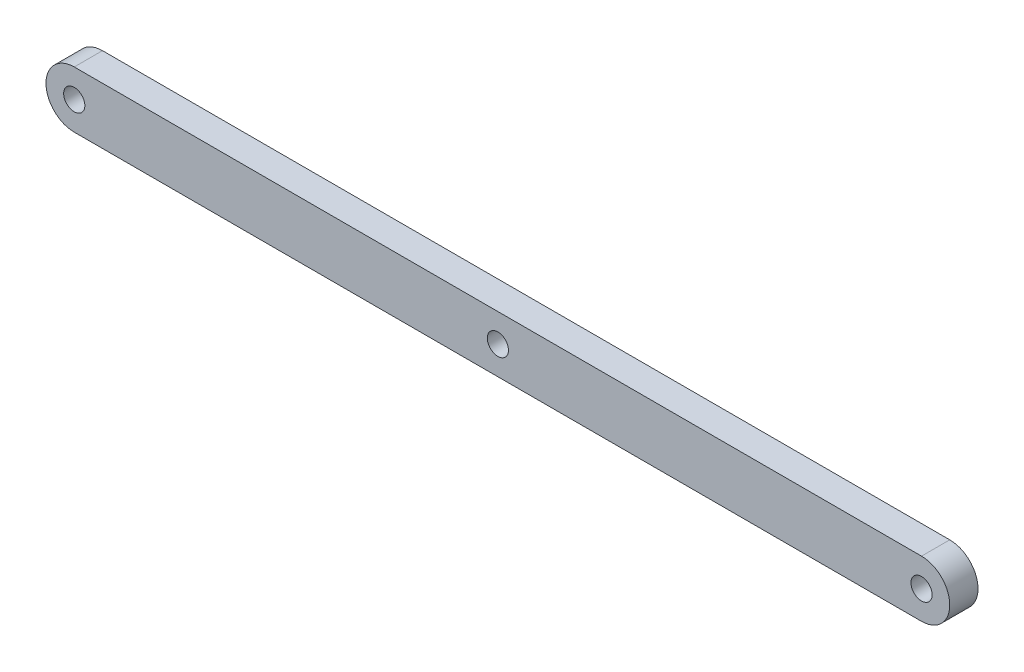
ISO-10303-21;
HEADER;
FILE_DESCRIPTION(('STEP AP214'),'2;1');
FILE_NAME('part.step','',(''),(''),'','','');
FILE_SCHEMA(('AUTOMOTIVE_DESIGN { 1 0 10303 214 1 1 1 1 }'));
ENDSEC;
DATA;
#1=APPLICATION_CONTEXT('core data for automotive mechanical design processes');
#2=APPLICATION_PROTOCOL_DEFINITION('international standard','automotive_design',2000,#1);
#3=PRODUCT_CONTEXT('',#1,'mechanical');
#4=PRODUCT('Part','Part','',(#3));
#5=PRODUCT_RELATED_PRODUCT_CATEGORY('part','',(#4));
#6=PRODUCT_DEFINITION_FORMATION('','',#4);
#7=PRODUCT_DEFINITION_CONTEXT('part definition',#1,'design');
#8=PRODUCT_DEFINITION('design','',#6,#7);
#9=PRODUCT_DEFINITION_SHAPE('','',#8);
#10=(LENGTH_UNIT() NAMED_UNIT(*) SI_UNIT(.MILLI.,.METRE.));
#11=(NAMED_UNIT(*) PLANE_ANGLE_UNIT() SI_UNIT($,.RADIAN.));
#12=(NAMED_UNIT(*) SI_UNIT($,.STERADIAN.) SOLID_ANGLE_UNIT());
#13=UNCERTAINTY_MEASURE_WITH_UNIT(LENGTH_MEASURE(1.E-05),#10,'distance_accuracy_value','');
#14=(GEOMETRIC_REPRESENTATION_CONTEXT(3) GLOBAL_UNCERTAINTY_ASSIGNED_CONTEXT((#13)) GLOBAL_UNIT_ASSIGNED_CONTEXT((#10,
#11,#12)) REPRESENTATION_CONTEXT('',''));
#15=CARTESIAN_POINT('',(0.,0.,0.));
#16=DIRECTION('',(0.,0.,1.));
#17=DIRECTION('',(1.,0.,0.));
#18=AXIS2_PLACEMENT_3D('',#15,#16,#17);
#19=CARTESIAN_POINT('',(0.,20.,-20.));
#20=DIRECTION('',(0.,0.,1.));
#21=DIRECTION('',(1.,0.,0.));
#22=AXIS2_PLACEMENT_3D('',#19,#20,#21);
#23=CYLINDRICAL_SURFACE('',#22,20.);
#24=CARTESIAN_POINT('',(0.,20.,0.));
#25=DIRECTION('',(0.,0.,1.));
#26=DIRECTION('',(1.,0.,0.));
#27=AXIS2_PLACEMENT_3D('',#24,#25,#26);
#28=CIRCLE('',#27,20.);
#29=CARTESIAN_POINT('',(0.,40.,0.));
#30=VERTEX_POINT('',#29);
#31=CARTESIAN_POINT('',(0.,0.,0.));
#32=VERTEX_POINT('',#31);
#33=EDGE_CURVE('E81',#30,#32,#28,.T.);
#34=ORIENTED_EDGE('',*,*,#33,.F.);
#35=DIRECTION('',(0.,0.,1.));
#36=VECTOR('',#35,1.);
#37=CARTESIAN_POINT('',(0.,40.,-20.));
#38=LINE('',#37,#36);
#39=CARTESIAN_POINT('',(0.,40.,-20.));
#40=VERTEX_POINT('',#39);
#41=EDGE_CURVE('E10',#40,#30,#38,.T.);
#42=ORIENTED_EDGE('',*,*,#41,.F.);
#43=CARTESIAN_POINT('',(0.,20.,-20.));
#44=DIRECTION('',(0.,0.,1.));
#45=DIRECTION('',(1.,0.,0.));
#46=AXIS2_PLACEMENT_3D('',#43,#44,#45);
#47=CIRCLE('',#46,20.);
#48=CARTESIAN_POINT('',(0.,0.,-20.));
#49=VERTEX_POINT('',#48);
#50=EDGE_CURVE('E74',#40,#49,#47,.T.);
#51=ORIENTED_EDGE('',*,*,#50,.T.);
#52=DIRECTION('',(0.,0.,1.));
#53=VECTOR('',#52,1.);
#54=CARTESIAN_POINT('',(0.,0.,-20.));
#55=LINE('',#54,#53);
#56=EDGE_CURVE('E19',#49,#32,#55,.T.);
#57=ORIENTED_EDGE('',*,*,#56,.T.);
#58=EDGE_LOOP('',(#34,#42,#51,#57));
#59=FACE_BOUND('',#58,.T.);
#60=ADVANCED_FACE('F16',(#59),#23,.T.);
#61=CARTESIAN_POINT('',(0.,40.,-20.));
#62=DIRECTION('',(0.,1.,0.));
#63=DIRECTION('',(0.,0.,1.));
#64=AXIS2_PLACEMENT_3D('',#61,#62,#63);
#65=PLANE('',#64);
#66=DIRECTION('',(-1.,0.,0.));
#67=VECTOR('',#66,1.);
#68=CARTESIAN_POINT('',(0.,40.,0.));
#69=LINE('',#68,#67);
#70=CARTESIAN_POINT('',(600.,40.,0.));
#71=VERTEX_POINT('',#70);
#72=EDGE_CURVE('E76',#71,#30,#69,.T.);
#73=ORIENTED_EDGE('',*,*,#72,.F.);
#74=DIRECTION('',(0.,0.,1.));
#75=VECTOR('',#74,1.);
#76=CARTESIAN_POINT('',(600.,40.,-20.));
#77=LINE('',#76,#75);
#78=CARTESIAN_POINT('',(600.,40.,-20.));
#79=VERTEX_POINT('',#78);
#80=EDGE_CURVE('E25',#79,#71,#77,.T.);
#81=ORIENTED_EDGE('',*,*,#80,.F.);
#82=DIRECTION('',(-1.,0.,0.));
#83=VECTOR('',#82,1.);
#84=CARTESIAN_POINT('',(0.,40.,-20.));
#85=LINE('',#84,#83);
#86=EDGE_CURVE('E71',#79,#40,#85,.T.);
#87=ORIENTED_EDGE('',*,*,#86,.T.);
#88=ORIENTED_EDGE('',*,*,#41,.T.);
#89=EDGE_LOOP('',(#73,#81,#87,#88));
#90=FACE_BOUND('',#89,.T.);
#91=ADVANCED_FACE('F92',(#90),#65,.T.);
#92=CARTESIAN_POINT('',(600.,20.,-20.));
#93=DIRECTION('',(0.,0.,1.));
#94=DIRECTION('',(1.,0.,0.));
#95=AXIS2_PLACEMENT_3D('',#92,#93,#94);
#96=CYLINDRICAL_SURFACE('',#95,20.);
#97=CARTESIAN_POINT('',(600.,20.,0.));
#98=DIRECTION('',(0.,0.,1.));
#99=DIRECTION('',(1.,0.,0.));
#100=AXIS2_PLACEMENT_3D('',#97,#98,#99);
#101=CIRCLE('',#100,20.);
#102=CARTESIAN_POINT('',(600.,0.,0.));
#103=VERTEX_POINT('',#102);
#104=EDGE_CURVE('E66',#103,#71,#101,.T.);
#105=ORIENTED_EDGE('',*,*,#104,.F.);
#106=DIRECTION('',(0.,0.,1.));
#107=VECTOR('',#106,1.);
#108=CARTESIAN_POINT('',(600.,0.,-20.));
#109=LINE('',#108,#107);
#110=CARTESIAN_POINT('',(600.,0.,-20.));
#111=VERTEX_POINT('',#110);
#112=EDGE_CURVE('E61',#111,#103,#109,.T.);
#113=ORIENTED_EDGE('',*,*,#112,.F.);
#114=CARTESIAN_POINT('',(600.,20.,-20.));
#115=DIRECTION('',(0.,0.,1.));
#116=DIRECTION('',(1.,0.,0.));
#117=AXIS2_PLACEMENT_3D('',#114,#115,#116);
#118=CIRCLE('',#117,20.);
#119=EDGE_CURVE('E64',#111,#79,#118,.T.);
#120=ORIENTED_EDGE('',*,*,#119,.T.);
#121=ORIENTED_EDGE('',*,*,#80,.T.);
#122=EDGE_LOOP('',(#105,#113,#120,#121));
#123=FACE_BOUND('',#122,.T.);
#124=ADVANCED_FACE('F63',(#123),#96,.T.);
#125=CARTESIAN_POINT('',(0.,0.,-20.));
#126=DIRECTION('',(0.,-1.,0.));
#127=DIRECTION('',(0.,0.,-1.));
#128=AXIS2_PLACEMENT_3D('',#125,#126,#127);
#129=PLANE('',#128);
#130=DIRECTION('',(1.,0.,0.));
#131=VECTOR('',#130,1.);
#132=CARTESIAN_POINT('',(0.,0.,0.));
#133=LINE('',#132,#131);
#134=EDGE_CURVE('E84',#32,#103,#133,.T.);
#135=ORIENTED_EDGE('',*,*,#134,.F.);
#136=ORIENTED_EDGE('',*,*,#56,.F.);
#137=DIRECTION('',(1.,0.,0.));
#138=VECTOR('',#137,1.);
#139=CARTESIAN_POINT('',(0.,0.,-20.));
#140=LINE('',#139,#138);
#141=EDGE_CURVE('E70',#49,#111,#140,.T.);
#142=ORIENTED_EDGE('',*,*,#141,.T.);
#143=ORIENTED_EDGE('',*,*,#112,.T.);
#144=EDGE_LOOP('',(#135,#136,#142,#143));
#145=FACE_BOUND('',#144,.T.);
#146=ADVANCED_FACE('F73',(#145),#129,.T.);
#147=CARTESIAN_POINT('',(0.,20.,-20.));
#148=DIRECTION('',(0.,0.,1.));
#149=DIRECTION('',(1.,0.,0.));
#150=AXIS2_PLACEMENT_3D('',#147,#148,#149);
#151=PLANE('',#150);
#152=CARTESIAN_POINT('',(300.,20.,-20.));
#153=DIRECTION('',(0.,0.,1.));
#154=DIRECTION('',(1.,0.,0.));
#155=AXIS2_PLACEMENT_3D('',#152,#153,#154);
#156=CIRCLE('',#155,7.5);
#157=CARTESIAN_POINT('',(307.5,20.,-20.));
#158=VERTEX_POINT('',#157);
#159=EDGE_CURVE('E134',#158,#158,#156,.T.);
#160=ORIENTED_EDGE('',*,*,#159,.T.);
#161=EDGE_LOOP('',(#160));
#162=FACE_BOUND('',#161,.T.);
#163=CARTESIAN_POINT('',(600.,20.,-20.));
#164=DIRECTION('',(0.,0.,1.));
#165=DIRECTION('',(1.,0.,0.));
#166=AXIS2_PLACEMENT_3D('',#163,#164,#165);
#167=CIRCLE('',#166,7.5);
#168=CARTESIAN_POINT('',(607.5,20.,-20.));
#169=VERTEX_POINT('',#168);
#170=EDGE_CURVE('E142',#169,#169,#167,.T.);
#171=ORIENTED_EDGE('',*,*,#170,.T.);
#172=EDGE_LOOP('',(#171));
#173=FACE_BOUND('',#172,.T.);
#174=CARTESIAN_POINT('',(0.,20.,-20.));
#175=DIRECTION('',(0.,0.,1.));
#176=DIRECTION('',(1.,0.,0.));
#177=AXIS2_PLACEMENT_3D('',#174,#175,#176);
#178=CIRCLE('',#177,7.5);
#179=CARTESIAN_POINT('',(7.5,20.,-20.));
#180=VERTEX_POINT('',#179);
#181=EDGE_CURVE('E85',#180,#180,#178,.T.);
#182=ORIENTED_EDGE('',*,*,#181,.T.);
#183=EDGE_LOOP('',(#182));
#184=FACE_BOUND('',#183,.T.);
#185=ORIENTED_EDGE('',*,*,#50,.F.);
#186=ORIENTED_EDGE('',*,*,#86,.F.);
#187=ORIENTED_EDGE('',*,*,#119,.F.);
#188=ORIENTED_EDGE('',*,*,#141,.F.);
#189=EDGE_LOOP('',(#185,#186,#187,#188));
#190=FACE_BOUND('',#189,.T.);
#191=ADVANCED_FACE('F69',(#162,#173,#184,#190),#151,.F.);
#192=CARTESIAN_POINT('',(0.,20.,0.));
#193=DIRECTION('',(0.,0.,1.));
#194=DIRECTION('',(1.,0.,0.));
#195=AXIS2_PLACEMENT_3D('',#192,#193,#194);
#196=PLANE('',#195);
#197=CARTESIAN_POINT('',(300.,20.,0.));
#198=DIRECTION('',(0.,0.,1.));
#199=DIRECTION('',(1.,0.,0.));
#200=AXIS2_PLACEMENT_3D('',#197,#198,#199);
#201=CIRCLE('',#200,7.5);
#202=CARTESIAN_POINT('',(307.5,20.,0.));
#203=VERTEX_POINT('',#202);
#204=EDGE_CURVE('E137',#203,#203,#201,.T.);
#205=ORIENTED_EDGE('',*,*,#204,.F.);
#206=EDGE_LOOP('',(#205));
#207=FACE_BOUND('',#206,.T.);
#208=CARTESIAN_POINT('',(600.,20.,0.));
#209=DIRECTION('',(0.,0.,1.));
#210=DIRECTION('',(1.,0.,0.));
#211=AXIS2_PLACEMENT_3D('',#208,#209,#210);
#212=CIRCLE('',#211,7.5);
#213=CARTESIAN_POINT('',(607.5,20.,0.));
#214=VERTEX_POINT('',#213);
#215=EDGE_CURVE('E139',#214,#214,#212,.T.);
#216=ORIENTED_EDGE('',*,*,#215,.F.);
#217=EDGE_LOOP('',(#216));
#218=FACE_BOUND('',#217,.T.);
#219=CARTESIAN_POINT('',(0.,20.,0.));
#220=DIRECTION('',(0.,0.,1.));
#221=DIRECTION('',(1.,0.,0.));
#222=AXIS2_PLACEMENT_3D('',#219,#220,#221);
#223=CIRCLE('',#222,7.5);
#224=CARTESIAN_POINT('',(7.5,20.,0.));
#225=VERTEX_POINT('',#224);
#226=EDGE_CURVE('E145',#225,#225,#223,.T.);
#227=ORIENTED_EDGE('',*,*,#226,.F.);
#228=EDGE_LOOP('',(#227));
#229=FACE_BOUND('',#228,.T.);
#230=ORIENTED_EDGE('',*,*,#33,.T.);
#231=ORIENTED_EDGE('',*,*,#134,.T.);
#232=ORIENTED_EDGE('',*,*,#104,.T.);
#233=ORIENTED_EDGE('',*,*,#72,.T.);
#234=EDGE_LOOP('',(#230,#231,#232,#233));
#235=FACE_BOUND('',#234,.T.);
#236=ADVANCED_FACE('F91',(#207,#218,#229,#235),#196,.T.);
#237=CARTESIAN_POINT('',(0.,20.,-20.));
#238=DIRECTION('',(0.,0.,1.));
#239=DIRECTION('',(1.,0.,0.));
#240=AXIS2_PLACEMENT_3D('',#237,#238,#239);
#241=CYLINDRICAL_SURFACE('',#240,7.5);
#242=ORIENTED_EDGE('',*,*,#181,.F.);
#243=EDGE_LOOP('',(#242));
#244=FACE_BOUND('',#243,.T.);
#245=ORIENTED_EDGE('',*,*,#226,.T.);
#246=EDGE_LOOP('',(#245));
#247=FACE_BOUND('',#246,.T.);
#248=ADVANCED_FACE('F114',(#244,#247),#241,.F.);
#249=CARTESIAN_POINT('',(600.,20.,-20.));
#250=DIRECTION('',(0.,0.,1.));
#251=DIRECTION('',(1.,0.,0.));
#252=AXIS2_PLACEMENT_3D('',#249,#250,#251);
#253=CYLINDRICAL_SURFACE('',#252,7.5);
#254=ORIENTED_EDGE('',*,*,#170,.F.);
#255=EDGE_LOOP('',(#254));
#256=FACE_BOUND('',#255,.T.);
#257=ORIENTED_EDGE('',*,*,#215,.T.);
#258=EDGE_LOOP('',(#257));
#259=FACE_BOUND('',#258,.T.);
#260=ADVANCED_FACE('F121',(#256,#259),#253,.F.);
#261=CARTESIAN_POINT('',(300.,20.,-20.));
#262=DIRECTION('',(0.,0.,1.));
#263=DIRECTION('',(1.,0.,0.));
#264=AXIS2_PLACEMENT_3D('',#261,#262,#263);
#265=CYLINDRICAL_SURFACE('',#264,7.5);
#266=ORIENTED_EDGE('',*,*,#159,.F.);
#267=EDGE_LOOP('',(#266));
#268=FACE_BOUND('',#267,.T.);
#269=ORIENTED_EDGE('',*,*,#204,.T.);
#270=EDGE_LOOP('',(#269));
#271=FACE_BOUND('',#270,.T.);
#272=ADVANCED_FACE('F125',(#268,#271),#265,.F.);
#273=CLOSED_SHELL('',(#60,#91,#124,#146,#191,#236,#248,#260,#272));
#274=MANIFOLD_SOLID_BREP('B1',#273);
#275=ADVANCED_BREP_SHAPE_REPRESENTATION('',(#18,#274),#14);
#276=SHAPE_DEFINITION_REPRESENTATION(#9,#275);
ENDSEC;
END-ISO-10303-21;
